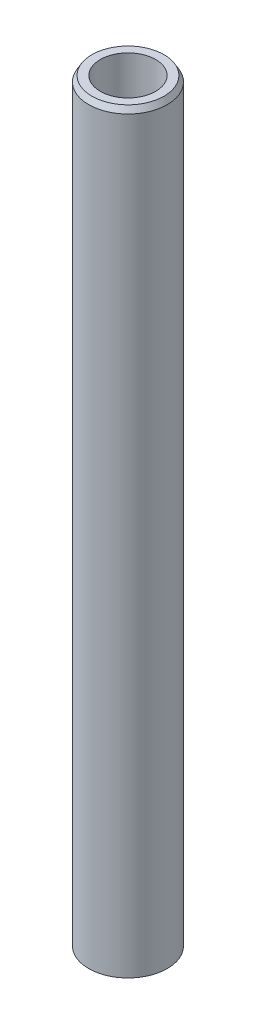
ISO-10303-21;
HEADER;
FILE_DESCRIPTION(('STEP AP214'),'2;1');
FILE_NAME('part.step','',(''),(''),'','','');
FILE_SCHEMA(('AUTOMOTIVE_DESIGN { 1 0 10303 214 1 1 1 1 }'));
ENDSEC;
DATA;
#1=APPLICATION_CONTEXT('core data for automotive mechanical design processes');
#2=APPLICATION_PROTOCOL_DEFINITION('international standard','automotive_design',2000,#1);
#3=PRODUCT_CONTEXT('',#1,'mechanical');
#4=PRODUCT('Part','Part','',(#3));
#5=PRODUCT_RELATED_PRODUCT_CATEGORY('part','',(#4));
#6=PRODUCT_DEFINITION_FORMATION('','',#4);
#7=PRODUCT_DEFINITION_CONTEXT('part definition',#1,'design');
#8=PRODUCT_DEFINITION('design','',#6,#7);
#9=PRODUCT_DEFINITION_SHAPE('','',#8);
#10=(LENGTH_UNIT() NAMED_UNIT(*) SI_UNIT(.MILLI.,.METRE.));
#11=(NAMED_UNIT(*) PLANE_ANGLE_UNIT() SI_UNIT($,.RADIAN.));
#12=(NAMED_UNIT(*) SI_UNIT($,.STERADIAN.) SOLID_ANGLE_UNIT());
#13=UNCERTAINTY_MEASURE_WITH_UNIT(LENGTH_MEASURE(1.E-05),#10,'distance_accuracy_value','');
#14=(GEOMETRIC_REPRESENTATION_CONTEXT(3) GLOBAL_UNCERTAINTY_ASSIGNED_CONTEXT((#13)) GLOBAL_UNIT_ASSIGNED_CONTEXT((#10,
#11,#12)) REPRESENTATION_CONTEXT('',''));
#15=CARTESIAN_POINT('',(0.,0.,0.));
#16=DIRECTION('',(0.,0.,1.));
#17=DIRECTION('',(1.,0.,0.));
#18=AXIS2_PLACEMENT_3D('',#15,#16,#17);
#19=CARTESIAN_POINT('',(0.,288.976468527666,0.));
#20=DIRECTION('',(0.,-1.,0.));
#21=DIRECTION('',(0.,0.,-1.));
#22=AXIS2_PLACEMENT_3D('',#19,#20,#21);
#23=CYLINDRICAL_SURFACE('',#22,15.);
#24=CARTESIAN_POINT('',(0.,286.814951265911,0.));
#25=DIRECTION('',(0.,1.,0.));
#26=DIRECTION('',(0.,0.,1.));
#27=AXIS2_PLACEMENT_3D('',#24,#25,#26);
#28=CIRCLE('',#27,15.);
#29=CARTESIAN_POINT('',(0.,286.814951265911,15.));
#30=VERTEX_POINT('',#29);
#31=EDGE_CURVE('E50',#30,#30,#28,.F.);
#32=ORIENTED_EDGE('',*,*,#31,.T.);
#33=EDGE_LOOP('',(#32));
#34=FACE_BOUND('',#33,.T.);
#35=CARTESIAN_POINT('',(0.,1.2479525729322,0.));
#36=DIRECTION('',(0.,1.,0.));
#37=DIRECTION('',(0.,0.,1.));
#38=AXIS2_PLACEMENT_3D('',#35,#36,#37);
#39=CIRCLE('',#38,15.);
#40=CARTESIAN_POINT('',(0.,1.2479525729322,15.));
#41=VERTEX_POINT('',#40);
#42=EDGE_CURVE('E51',#41,#41,#39,.T.);
#43=ORIENTED_EDGE('',*,*,#42,.T.);
#44=EDGE_LOOP('',(#43));
#45=FACE_BOUND('',#44,.T.);
#46=ADVANCED_FACE('F39',(#34,#45),#23,.T.);
#47=CARTESIAN_POINT('',(0.,288.976468527666,0.));
#48=DIRECTION('',(0.,1.,0.));
#49=DIRECTION('',(0.,0.,1.));
#50=AXIS2_PLACEMENT_3D('',#47,#48,#49);
#51=PLANE('',#50);
#52=CARTESIAN_POINT('',(0.,288.976468527666,0.));
#53=DIRECTION('',(0.,1.,0.));
#54=DIRECTION('',(0.,0.,1.));
#55=AXIS2_PLACEMENT_3D('',#52,#53,#54);
#56=CIRCLE('',#55,13.7520474270678);
#57=CARTESIAN_POINT('',(0.,288.976468527666,13.7520474270678));
#58=VERTEX_POINT('',#57);
#59=EDGE_CURVE('E54',#58,#58,#56,.T.);
#60=ORIENTED_EDGE('',*,*,#59,.T.);
#61=EDGE_LOOP('',(#60));
#62=FACE_BOUND('',#61,.T.);
#63=CARTESIAN_POINT('',(0.,288.976468527666,0.));
#64=DIRECTION('',(0.,1.,0.));
#65=DIRECTION('',(0.,0.,1.));
#66=AXIS2_PLACEMENT_3D('',#63,#64,#65);
#67=CIRCLE('',#66,10.5559764105402);
#68=CARTESIAN_POINT('',(0.,288.976468527666,10.5559764105402));
#69=VERTEX_POINT('',#68);
#70=EDGE_CURVE('E58',#69,#69,#67,.T.);
#71=ORIENTED_EDGE('',*,*,#70,.F.);
#72=EDGE_LOOP('',(#71));
#73=FACE_BOUND('',#72,.T.);
#74=ADVANCED_FACE('F69',(#62,#73),#51,.T.);
#75=CARTESIAN_POINT('',(0.,0.,0.));
#76=DIRECTION('',(0.,1.,0.));
#77=DIRECTION('',(0.,0.,1.));
#78=AXIS2_PLACEMENT_3D('',#75,#76,#77);
#79=PLANE('',#78);
#80=CARTESIAN_POINT('',(0.,0.,0.));
#81=DIRECTION('',(0.,1.,0.));
#82=DIRECTION('',(0.,0.,1.));
#83=AXIS2_PLACEMENT_3D('',#80,#81,#82);
#84=CIRCLE('',#83,12.8384827382451);
#85=CARTESIAN_POINT('',(0.,0.,12.8384827382451));
#86=VERTEX_POINT('',#85);
#87=EDGE_CURVE('E10',#86,#86,#84,.F.);
#88=ORIENTED_EDGE('',*,*,#87,.T.);
#89=EDGE_LOOP('',(#88));
#90=FACE_BOUND('',#89,.T.);
#91=CARTESIAN_POINT('',(0.,0.,0.));
#92=DIRECTION('',(0.,1.,0.));
#93=DIRECTION('',(0.,0.,1.));
#94=AXIS2_PLACEMENT_3D('',#91,#92,#93);
#95=CIRCLE('',#94,10.5559764105402);
#96=CARTESIAN_POINT('',(0.,0.,10.5559764105402));
#97=VERTEX_POINT('',#96);
#98=EDGE_CURVE('E63',#97,#97,#95,.T.);
#99=ORIENTED_EDGE('',*,*,#98,.T.);
#100=EDGE_LOOP('',(#99));
#101=FACE_BOUND('',#100,.T.);
#102=ADVANCED_FACE('F75',(#90,#101),#79,.F.);
#103=CARTESIAN_POINT('',(0.,288.976468527666,0.));
#104=DIRECTION('',(0.,-1.,0.));
#105=DIRECTION('',(0.,0.,-1.));
#106=AXIS2_PLACEMENT_3D('',#103,#104,#105);
#107=CYLINDRICAL_SURFACE('',#106,10.5559764105402);
#108=ORIENTED_EDGE('',*,*,#70,.T.);
#109=EDGE_LOOP('',(#108));
#110=FACE_BOUND('',#109,.T.);
#111=ORIENTED_EDGE('',*,*,#98,.F.);
#112=EDGE_LOOP('',(#111));
#113=FACE_BOUND('',#112,.T.);
#114=ADVANCED_FACE('F70',(#110,#113),#107,.F.);
#115=CARTESIAN_POINT('',(0.,288.976468527666,0.));
#116=DIRECTION('',(0.,-1.,0.));
#117=DIRECTION('',(0.,0.,-1.));
#118=AXIS2_PLACEMENT_3D('',#115,#116,#117);
#119=CONICAL_SURFACE('',#118,13.7520474270678,0.523598775598299);
#120=ORIENTED_EDGE('',*,*,#31,.F.);
#121=EDGE_LOOP('',(#120));
#122=FACE_BOUND('',#121,.T.);
#123=ORIENTED_EDGE('',*,*,#59,.F.);
#124=EDGE_LOOP('',(#123));
#125=FACE_BOUND('',#124,.T.);
#126=ADVANCED_FACE('F81',(#122,#125),#119,.T.);
#127=CARTESIAN_POINT('',(0.,1.2479525729322,0.));
#128=DIRECTION('',(0.,1.,0.));
#129=DIRECTION('',(0.,0.,1.));
#130=AXIS2_PLACEMENT_3D('',#127,#128,#129);
#131=CONICAL_SURFACE('',#130,15.,1.0471975511966);
#132=ORIENTED_EDGE('',*,*,#87,.F.);
#133=EDGE_LOOP('',(#132));
#134=FACE_BOUND('',#133,.T.);
#135=ORIENTED_EDGE('',*,*,#42,.F.);
#136=EDGE_LOOP('',(#135));
#137=FACE_BOUND('',#136,.T.);
#138=ADVANCED_FACE('F45',(#134,#137),#131,.T.);
#139=CLOSED_SHELL('',(#46,#74,#102,#114,#126,#138));
#140=MANIFOLD_SOLID_BREP('B2',#139);
#141=ADVANCED_BREP_SHAPE_REPRESENTATION('',(#18,#140),#14);
#142=SHAPE_DEFINITION_REPRESENTATION(#9,#141);
ENDSEC;
END-ISO-10303-21;
